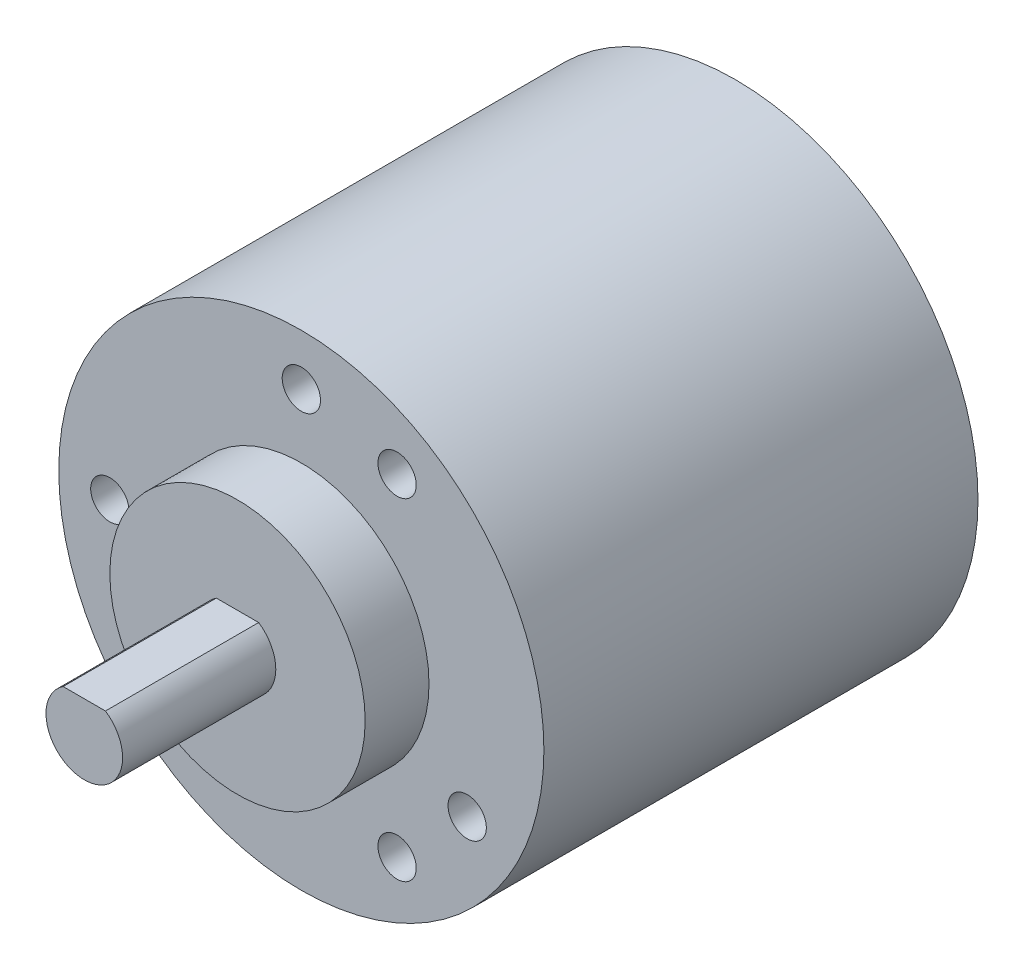
ISO-10303-21;
HEADER;
FILE_DESCRIPTION(('STEP AP214'),'2;1');
FILE_NAME('part.step','',(''),(''),'','','');
FILE_SCHEMA(('AUTOMOTIVE_DESIGN { 1 0 10303 214 1 1 1 1 }'));
ENDSEC;
DATA;
#1=APPLICATION_CONTEXT('core data for automotive mechanical design processes');
#2=APPLICATION_PROTOCOL_DEFINITION('international standard','automotive_design',2000,#1);
#3=PRODUCT_CONTEXT('',#1,'mechanical');
#4=PRODUCT('Part','Part','',(#3));
#5=PRODUCT_RELATED_PRODUCT_CATEGORY('part','',(#4));
#6=PRODUCT_DEFINITION_FORMATION('','',#4);
#7=PRODUCT_DEFINITION_CONTEXT('part definition',#1,'design');
#8=PRODUCT_DEFINITION('design','',#6,#7);
#9=PRODUCT_DEFINITION_SHAPE('','',#8);
#10=(LENGTH_UNIT() NAMED_UNIT(*) SI_UNIT(.MILLI.,.METRE.));
#11=(NAMED_UNIT(*) PLANE_ANGLE_UNIT() SI_UNIT($,.RADIAN.));
#12=(NAMED_UNIT(*) SI_UNIT($,.STERADIAN.) SOLID_ANGLE_UNIT());
#13=UNCERTAINTY_MEASURE_WITH_UNIT(LENGTH_MEASURE(1.E-05),#10,'distance_accuracy_value','');
#14=(GEOMETRIC_REPRESENTATION_CONTEXT(3) GLOBAL_UNCERTAINTY_ASSIGNED_CONTEXT((#13)) GLOBAL_UNIT_ASSIGNED_CONTEXT((#10,
#11,#12)) REPRESENTATION_CONTEXT('',''));
#15=CARTESIAN_POINT('',(0.,0.,0.));
#16=DIRECTION('',(0.,0.,1.));
#17=DIRECTION('',(1.,0.,0.));
#18=AXIS2_PLACEMENT_3D('',#15,#16,#17);
#19=CARTESIAN_POINT('',(0.,0.,34.));
#20=DIRECTION('',(0.,0.,-1.));
#21=DIRECTION('',(-1.,0.,0.));
#22=AXIS2_PLACEMENT_3D('',#19,#20,#21);
#23=CYLINDRICAL_SURFACE('',#22,19.);
#24=CARTESIAN_POINT('',(0.,0.,34.));
#25=DIRECTION('',(0.,0.,1.));
#26=DIRECTION('',(1.,0.,0.));
#27=AXIS2_PLACEMENT_3D('',#24,#25,#26);
#28=CIRCLE('',#27,19.);
#29=CARTESIAN_POINT('',(19.,0.,34.));
#30=VERTEX_POINT('',#29);
#31=EDGE_CURVE('E11',#30,#30,#28,.T.);
#32=ORIENTED_EDGE('',*,*,#31,.F.);
#33=EDGE_LOOP('',(#32));
#34=FACE_BOUND('',#33,.T.);
#35=CARTESIAN_POINT('',(0.,0.,0.));
#36=DIRECTION('',(0.,0.,1.));
#37=DIRECTION('',(1.,0.,0.));
#38=AXIS2_PLACEMENT_3D('',#35,#36,#37);
#39=CIRCLE('',#38,19.);
#40=CARTESIAN_POINT('',(19.,0.,0.));
#41=VERTEX_POINT('',#40);
#42=EDGE_CURVE('E40',#41,#41,#39,.T.);
#43=ORIENTED_EDGE('',*,*,#42,.T.);
#44=EDGE_LOOP('',(#43));
#45=FACE_BOUND('',#44,.T.);
#46=ADVANCED_FACE('F37',(#34,#45),#23,.T.);
#47=CARTESIAN_POINT('',(0.,0.,34.));
#48=DIRECTION('',(0.,0.,1.));
#49=DIRECTION('',(1.,0.,0.));
#50=AXIS2_PLACEMENT_3D('',#47,#48,#49);
#51=PLANE('',#50);
#52=CARTESIAN_POINT('',(0.,0.,34.));
#53=DIRECTION('',(0.,0.,1.));
#54=DIRECTION('',(1.,0.,0.));
#55=AXIS2_PLACEMENT_3D('',#52,#53,#54);
#56=CIRCLE('',#55,10.);
#57=CARTESIAN_POINT('',(10.,0.,34.));
#58=VERTEX_POINT('',#57);
#59=EDGE_CURVE('E79',#58,#58,#56,.T.);
#60=ORIENTED_EDGE('',*,*,#59,.F.);
#61=EDGE_LOOP('',(#60));
#62=FACE_BOUND('',#61,.T.);
#63=CARTESIAN_POINT('',(7.5000000000019,-12.9903810567662,34.));
#64=DIRECTION('',(0.,0.,1.));
#65=DIRECTION('',(1.,0.,0.));
#66=AXIS2_PLACEMENT_3D('',#63,#64,#65);
#67=CIRCLE('',#66,1.5);
#68=CARTESIAN_POINT('',(9.0000000000019,-12.9903810567662,34.));
#69=VERTEX_POINT('',#68);
#70=EDGE_CURVE('E86',#69,#69,#67,.T.);
#71=ORIENTED_EDGE('',*,*,#70,.F.);
#72=EDGE_LOOP('',(#71));
#73=FACE_BOUND('',#72,.T.);
#74=CARTESIAN_POINT('',(12.9903810567684,-7.49999999999967,34.));
#75=DIRECTION('',(0.,0.,1.));
#76=DIRECTION('',(1.,0.,0.));
#77=AXIS2_PLACEMENT_3D('',#74,#75,#76);
#78=CIRCLE('',#77,1.50000000000079);
#79=CARTESIAN_POINT('',(14.4903810567692,-7.49999999999967,34.));
#80=VERTEX_POINT('',#79);
#81=EDGE_CURVE('E111',#80,#80,#78,.T.);
#82=ORIENTED_EDGE('',*,*,#81,.F.);
#83=EDGE_LOOP('',(#82));
#84=FACE_BOUND('',#83,.T.);
#85=CARTESIAN_POINT('',(7.49999999999992,12.9903810567666,34.));
#86=DIRECTION('',(0.,0.,1.));
#87=DIRECTION('',(1.,0.,0.));
#88=AXIS2_PLACEMENT_3D('',#85,#86,#87);
#89=CIRCLE('',#88,1.5);
#90=CARTESIAN_POINT('',(8.99999999999992,12.9903810567666,34.));
#91=VERTEX_POINT('',#90);
#92=EDGE_CURVE('E105',#91,#91,#89,.T.);
#93=ORIENTED_EDGE('',*,*,#92,.F.);
#94=EDGE_LOOP('',(#93));
#95=FACE_BOUND('',#94,.T.);
#96=CARTESIAN_POINT('',(0.,15.,34.));
#97=DIRECTION('',(0.,0.,1.));
#98=DIRECTION('',(1.,0.,0.));
#99=AXIS2_PLACEMENT_3D('',#96,#97,#98);
#100=CIRCLE('',#99,1.5);
#101=CARTESIAN_POINT('',(1.5,15.,34.));
#102=VERTEX_POINT('',#101);
#103=EDGE_CURVE('E99',#102,#102,#100,.T.);
#104=ORIENTED_EDGE('',*,*,#103,.F.);
#105=EDGE_LOOP('',(#104));
#106=FACE_BOUND('',#105,.T.);
#107=CARTESIAN_POINT('',(-14.9999999999988,-1.5109441475758E-12,34.));
#108=DIRECTION('',(0.,0.,1.));
#109=DIRECTION('',(1.,0.,0.));
#110=AXIS2_PLACEMENT_3D('',#107,#108,#109);
#111=CIRCLE('',#110,1.5);
#112=CARTESIAN_POINT('',(-13.4999999999988,-1.5109441475758E-12,34.));
#113=VERTEX_POINT('',#112);
#114=EDGE_CURVE('E93',#113,#113,#111,.T.);
#115=ORIENTED_EDGE('',*,*,#114,.F.);
#116=EDGE_LOOP('',(#115));
#117=FACE_BOUND('',#116,.T.);
#118=CARTESIAN_POINT('',(-12.9903810567654,-7.50000000000142,34.));
#119=DIRECTION('',(0.,0.,1.));
#120=DIRECTION('',(1.,0.,0.));
#121=AXIS2_PLACEMENT_3D('',#118,#119,#120);
#122=CIRCLE('',#121,1.50000000000197);
#123=CARTESIAN_POINT('',(-11.4903810567634,-7.50000000000142,34.));
#124=VERTEX_POINT('',#123);
#125=EDGE_CURVE('E92',#124,#124,#122,.T.);
#126=ORIENTED_EDGE('',*,*,#125,.F.);
#127=EDGE_LOOP('',(#126));
#128=FACE_BOUND('',#127,.T.);
#129=ORIENTED_EDGE('',*,*,#31,.T.);
#130=EDGE_LOOP('',(#129));
#131=FACE_BOUND('',#130,.T.);
#132=ADVANCED_FACE('F127',(#62,#73,#84,#95,#106,#117,#128,#131),#51,.T.);
#133=CARTESIAN_POINT('',(0.,0.,0.));
#134=DIRECTION('',(0.,0.,1.));
#135=DIRECTION('',(1.,0.,0.));
#136=AXIS2_PLACEMENT_3D('',#133,#134,#135);
#137=PLANE('',#136);
#138=ORIENTED_EDGE('',*,*,#42,.F.);
#139=EDGE_LOOP('',(#138));
#140=FACE_BOUND('',#139,.T.);
#141=ADVANCED_FACE('F130',(#140),#137,.F.);
#142=CARTESIAN_POINT('',(-12.9903810567654,-7.50000000000142,28.));
#143=DIRECTION('',(0.,0.,1.));
#144=DIRECTION('',(1.,0.,0.));
#145=AXIS2_PLACEMENT_3D('',#142,#143,#144);
#146=CYLINDRICAL_SURFACE('',#145,1.50000000000197);
#147=CARTESIAN_POINT('',(-12.9903810567654,-7.50000000000142,28.));
#148=DIRECTION('',(0.,0.,1.));
#149=DIRECTION('',(1.,0.,0.));
#150=AXIS2_PLACEMENT_3D('',#147,#148,#149);
#151=CIRCLE('',#150,1.50000000000197);
#152=CARTESIAN_POINT('',(-11.4903810567634,-7.50000000000142,28.));
#153=VERTEX_POINT('',#152);
#154=EDGE_CURVE('E119',#153,#153,#151,.T.);
#155=ORIENTED_EDGE('',*,*,#154,.F.);
#156=EDGE_LOOP('',(#155));
#157=FACE_BOUND('',#156,.T.);
#158=ORIENTED_EDGE('',*,*,#125,.T.);
#159=EDGE_LOOP('',(#158));
#160=FACE_BOUND('',#159,.T.);
#161=ADVANCED_FACE('F125',(#157,#160),#146,.F.);
#162=CARTESIAN_POINT('',(0.,0.,28.));
#163=DIRECTION('',(0.,0.,1.));
#164=DIRECTION('',(1.,0.,0.));
#165=AXIS2_PLACEMENT_3D('',#162,#163,#164);
#166=PLANE('',#165);
#167=ORIENTED_EDGE('',*,*,#154,.T.);
#168=EDGE_LOOP('',(#167));
#169=FACE_BOUND('',#168,.T.);
#170=ADVANCED_FACE('F144',(#169),#166,.T.);
#171=CARTESIAN_POINT('',(-14.9999999999988,-1.5109441475758E-12,28.));
#172=DIRECTION('',(0.,0.,1.));
#173=DIRECTION('',(1.,0.,0.));
#174=AXIS2_PLACEMENT_3D('',#171,#172,#173);
#175=CYLINDRICAL_SURFACE('',#174,1.5);
#176=CARTESIAN_POINT('',(-14.9999999999988,-1.5109441475758E-12,28.));
#177=DIRECTION('',(0.,0.,1.));
#178=DIRECTION('',(1.,0.,0.));
#179=AXIS2_PLACEMENT_3D('',#176,#177,#178);
#180=CIRCLE('',#179,1.5);
#181=CARTESIAN_POINT('',(-13.4999999999988,-1.5109441475758E-12,28.));
#182=VERTEX_POINT('',#181);
#183=EDGE_CURVE('E89',#182,#182,#180,.T.);
#184=ORIENTED_EDGE('',*,*,#183,.F.);
#185=EDGE_LOOP('',(#184));
#186=FACE_BOUND('',#185,.T.);
#187=ORIENTED_EDGE('',*,*,#114,.T.);
#188=EDGE_LOOP('',(#187));
#189=FACE_BOUND('',#188,.T.);
#190=ADVANCED_FACE('F150',(#186,#189),#175,.F.);
#191=CARTESIAN_POINT('',(0.,0.,28.));
#192=DIRECTION('',(0.,0.,1.));
#193=DIRECTION('',(1.,0.,0.));
#194=AXIS2_PLACEMENT_3D('',#191,#192,#193);
#195=PLANE('',#194);
#196=ORIENTED_EDGE('',*,*,#183,.T.);
#197=EDGE_LOOP('',(#196));
#198=FACE_BOUND('',#197,.T.);
#199=ADVANCED_FACE('F181',(#198),#195,.T.);
#200=CARTESIAN_POINT('',(0.,15.,28.));
#201=DIRECTION('',(0.,0.,1.));
#202=DIRECTION('',(1.,0.,0.));
#203=AXIS2_PLACEMENT_3D('',#200,#201,#202);
#204=CYLINDRICAL_SURFACE('',#203,1.5);
#205=CARTESIAN_POINT('',(0.,15.,28.));
#206=DIRECTION('',(0.,0.,1.));
#207=DIRECTION('',(1.,0.,0.));
#208=AXIS2_PLACEMENT_3D('',#205,#206,#207);
#209=CIRCLE('',#208,1.5);
#210=CARTESIAN_POINT('',(1.5,15.,28.));
#211=VERTEX_POINT('',#210);
#212=EDGE_CURVE('E96',#211,#211,#209,.T.);
#213=ORIENTED_EDGE('',*,*,#212,.F.);
#214=EDGE_LOOP('',(#213));
#215=FACE_BOUND('',#214,.T.);
#216=ORIENTED_EDGE('',*,*,#103,.T.);
#217=EDGE_LOOP('',(#216));
#218=FACE_BOUND('',#217,.T.);
#219=ADVANCED_FACE('F178',(#215,#218),#204,.F.);
#220=CARTESIAN_POINT('',(0.,0.,28.));
#221=DIRECTION('',(0.,0.,1.));
#222=DIRECTION('',(1.,0.,0.));
#223=AXIS2_PLACEMENT_3D('',#220,#221,#222);
#224=PLANE('',#223);
#225=ORIENTED_EDGE('',*,*,#212,.T.);
#226=EDGE_LOOP('',(#225));
#227=FACE_BOUND('',#226,.T.);
#228=ADVANCED_FACE('F173',(#227),#224,.T.);
#229=CARTESIAN_POINT('',(7.49999999999992,12.9903810567666,28.));
#230=DIRECTION('',(0.,0.,1.));
#231=DIRECTION('',(1.,0.,0.));
#232=AXIS2_PLACEMENT_3D('',#229,#230,#231);
#233=CYLINDRICAL_SURFACE('',#232,1.5);
#234=CARTESIAN_POINT('',(7.49999999999992,12.9903810567666,28.));
#235=DIRECTION('',(0.,0.,1.));
#236=DIRECTION('',(1.,0.,0.));
#237=AXIS2_PLACEMENT_3D('',#234,#235,#236);
#238=CIRCLE('',#237,1.5);
#239=CARTESIAN_POINT('',(8.99999999999992,12.9903810567666,28.));
#240=VERTEX_POINT('',#239);
#241=EDGE_CURVE('E102',#240,#240,#238,.T.);
#242=ORIENTED_EDGE('',*,*,#241,.F.);
#243=EDGE_LOOP('',(#242));
#244=FACE_BOUND('',#243,.T.);
#245=ORIENTED_EDGE('',*,*,#92,.T.);
#246=EDGE_LOOP('',(#245));
#247=FACE_BOUND('',#246,.T.);
#248=ADVANCED_FACE('F170',(#244,#247),#233,.F.);
#249=CARTESIAN_POINT('',(0.,0.,28.));
#250=DIRECTION('',(0.,0.,1.));
#251=DIRECTION('',(1.,0.,0.));
#252=AXIS2_PLACEMENT_3D('',#249,#250,#251);
#253=PLANE('',#252);
#254=ORIENTED_EDGE('',*,*,#241,.T.);
#255=EDGE_LOOP('',(#254));
#256=FACE_BOUND('',#255,.T.);
#257=ADVANCED_FACE('F165',(#256),#253,.T.);
#258=CARTESIAN_POINT('',(12.9903810567684,-7.49999999999967,28.));
#259=DIRECTION('',(0.,0.,1.));
#260=DIRECTION('',(1.,0.,0.));
#261=AXIS2_PLACEMENT_3D('',#258,#259,#260);
#262=CYLINDRICAL_SURFACE('',#261,1.50000000000079);
#263=CARTESIAN_POINT('',(12.9903810567684,-7.49999999999967,28.));
#264=DIRECTION('',(0.,0.,1.));
#265=DIRECTION('',(1.,0.,0.));
#266=AXIS2_PLACEMENT_3D('',#263,#264,#265);
#267=CIRCLE('',#266,1.50000000000079);
#268=CARTESIAN_POINT('',(14.4903810567692,-7.49999999999967,28.));
#269=VERTEX_POINT('',#268);
#270=EDGE_CURVE('E108',#269,#269,#267,.T.);
#271=ORIENTED_EDGE('',*,*,#270,.F.);
#272=EDGE_LOOP('',(#271));
#273=FACE_BOUND('',#272,.T.);
#274=ORIENTED_EDGE('',*,*,#81,.T.);
#275=EDGE_LOOP('',(#274));
#276=FACE_BOUND('',#275,.T.);
#277=ADVANCED_FACE('F162',(#273,#276),#262,.F.);
#278=CARTESIAN_POINT('',(0.,0.,28.));
#279=DIRECTION('',(0.,0.,1.));
#280=DIRECTION('',(1.,0.,0.));
#281=AXIS2_PLACEMENT_3D('',#278,#279,#280);
#282=PLANE('',#281);
#283=ORIENTED_EDGE('',*,*,#270,.T.);
#284=EDGE_LOOP('',(#283));
#285=FACE_BOUND('',#284,.T.);
#286=ADVANCED_FACE('F156',(#285),#282,.T.);
#287=CARTESIAN_POINT('',(7.5000000000019,-12.9903810567662,28.));
#288=DIRECTION('',(0.,0.,1.));
#289=DIRECTION('',(1.,0.,0.));
#290=AXIS2_PLACEMENT_3D('',#287,#288,#289);
#291=CYLINDRICAL_SURFACE('',#290,1.5);
#292=CARTESIAN_POINT('',(7.5000000000019,-12.9903810567662,28.));
#293=DIRECTION('',(0.,0.,1.));
#294=DIRECTION('',(1.,0.,0.));
#295=AXIS2_PLACEMENT_3D('',#292,#293,#294);
#296=CIRCLE('',#295,1.5);
#297=CARTESIAN_POINT('',(9.0000000000019,-12.9903810567662,28.));
#298=VERTEX_POINT('',#297);
#299=EDGE_CURVE('E114',#298,#298,#296,.T.);
#300=ORIENTED_EDGE('',*,*,#299,.F.);
#301=EDGE_LOOP('',(#300));
#302=FACE_BOUND('',#301,.T.);
#303=ORIENTED_EDGE('',*,*,#70,.T.);
#304=EDGE_LOOP('',(#303));
#305=FACE_BOUND('',#304,.T.);
#306=ADVANCED_FACE('F152',(#302,#305),#291,.F.);
#307=CARTESIAN_POINT('',(0.,0.,28.));
#308=DIRECTION('',(0.,0.,1.));
#309=DIRECTION('',(1.,0.,0.));
#310=AXIS2_PLACEMENT_3D('',#307,#308,#309);
#311=PLANE('',#310);
#312=ORIENTED_EDGE('',*,*,#299,.T.);
#313=EDGE_LOOP('',(#312));
#314=FACE_BOUND('',#313,.T.);
#315=ADVANCED_FACE('F155',(#314),#311,.T.);
#316=CARTESIAN_POINT('',(0.,0.,39.));
#317=DIRECTION('',(0.,0.,-1.));
#318=DIRECTION('',(-1.,0.,0.));
#319=AXIS2_PLACEMENT_3D('',#316,#317,#318);
#320=CYLINDRICAL_SURFACE('',#319,10.);
#321=CARTESIAN_POINT('',(0.,0.,39.));
#322=DIRECTION('',(0.,0.,1.));
#323=DIRECTION('',(1.,0.,0.));
#324=AXIS2_PLACEMENT_3D('',#321,#322,#323);
#325=CIRCLE('',#324,10.);
#326=CARTESIAN_POINT('',(10.,0.,39.));
#327=VERTEX_POINT('',#326);
#328=EDGE_CURVE('E83',#327,#327,#325,.T.);
#329=ORIENTED_EDGE('',*,*,#328,.F.);
#330=EDGE_LOOP('',(#329));
#331=FACE_BOUND('',#330,.T.);
#332=ORIENTED_EDGE('',*,*,#59,.T.);
#333=EDGE_LOOP('',(#332));
#334=FACE_BOUND('',#333,.T.);
#335=ADVANCED_FACE('F160',(#331,#334),#320,.T.);
#336=CARTESIAN_POINT('',(0.,0.,39.));
#337=DIRECTION('',(0.,0.,1.));
#338=DIRECTION('',(1.,0.,0.));
#339=AXIS2_PLACEMENT_3D('',#336,#337,#338);
#340=PLANE('',#339);
#341=DIRECTION('',(-1.,0.,0.));
#342=VECTOR('',#341,1.);
#343=CARTESIAN_POINT('',(0.,2.5,39.));
#344=LINE('',#343,#342);
#345=CARTESIAN_POINT('',(1.6583123951777,2.5,39.));
#346=VERTEX_POINT('',#345);
#347=CARTESIAN_POINT('',(-1.6583123951777,2.5,39.));
#348=VERTEX_POINT('',#347);
#349=EDGE_CURVE('E63',#346,#348,#344,.T.);
#350=ORIENTED_EDGE('',*,*,#349,.F.);
#351=CARTESIAN_POINT('',(0.,0.,39.));
#352=DIRECTION('',(0.,0.,1.));
#353=DIRECTION('',(1.,0.,0.));
#354=AXIS2_PLACEMENT_3D('',#351,#352,#353);
#355=CIRCLE('',#354,3.);
#356=EDGE_CURVE('E50',#348,#346,#355,.T.);
#357=ORIENTED_EDGE('',*,*,#356,.F.);
#358=EDGE_LOOP('',(#350,#357));
#359=FACE_BOUND('',#358,.T.);
#360=ORIENTED_EDGE('',*,*,#328,.T.);
#361=EDGE_LOOP('',(#360));
#362=FACE_BOUND('',#361,.T.);
#363=ADVANCED_FACE('F64',(#359,#362),#340,.T.);
#364=CARTESIAN_POINT('',(0.,2.5,51.));
#365=DIRECTION('',(0.,-1.,0.));
#366=DIRECTION('',(0.,0.,-1.));
#367=AXIS2_PLACEMENT_3D('',#364,#365,#366);
#368=PLANE('',#367);
#369=ORIENTED_EDGE('',*,*,#349,.T.);
#370=DIRECTION('',(0.,0.,-1.));
#371=VECTOR('',#370,1.);
#372=CARTESIAN_POINT('',(-1.6583123951777,2.5,51.));
#373=LINE('',#372,#371);
#374=CARTESIAN_POINT('',(-1.6583123951777,2.5,51.));
#375=VERTEX_POINT('',#374);
#376=EDGE_CURVE('E74',#375,#348,#373,.T.);
#377=ORIENTED_EDGE('',*,*,#376,.F.);
#378=DIRECTION('',(-1.,0.,0.));
#379=VECTOR('',#378,1.);
#380=CARTESIAN_POINT('',(0.,2.5,51.));
#381=LINE('',#380,#379);
#382=CARTESIAN_POINT('',(1.6583123951777,2.5,51.));
#383=VERTEX_POINT('',#382);
#384=EDGE_CURVE('E75',#383,#375,#381,.T.);
#385=ORIENTED_EDGE('',*,*,#384,.F.);
#386=DIRECTION('',(0.,0.,-1.));
#387=VECTOR('',#386,1.);
#388=CARTESIAN_POINT('',(1.6583123951777,2.5,51.));
#389=LINE('',#388,#387);
#390=EDGE_CURVE('E72',#383,#346,#389,.T.);
#391=ORIENTED_EDGE('',*,*,#390,.T.);
#392=EDGE_LOOP('',(#369,#377,#385,#391));
#393=FACE_BOUND('',#392,.T.);
#394=ADVANCED_FACE('F77',(#393),#368,.F.);
#395=CARTESIAN_POINT('',(0.,0.,51.));
#396=DIRECTION('',(0.,0.,-1.));
#397=DIRECTION('',(-1.,0.,0.));
#398=AXIS2_PLACEMENT_3D('',#395,#396,#397);
#399=CYLINDRICAL_SURFACE('',#398,3.);
#400=ORIENTED_EDGE('',*,*,#356,.T.);
#401=ORIENTED_EDGE('',*,*,#390,.F.);
#402=CARTESIAN_POINT('',(0.,0.,51.));
#403=DIRECTION('',(0.,0.,1.));
#404=DIRECTION('',(1.,0.,0.));
#405=AXIS2_PLACEMENT_3D('',#402,#403,#404);
#406=CIRCLE('',#405,3.);
#407=EDGE_CURVE('E58',#375,#383,#406,.T.);
#408=ORIENTED_EDGE('',*,*,#407,.F.);
#409=ORIENTED_EDGE('',*,*,#376,.T.);
#410=EDGE_LOOP('',(#400,#401,#408,#409));
#411=FACE_BOUND('',#410,.T.);
#412=ADVANCED_FACE('F71',(#411),#399,.T.);
#413=CARTESIAN_POINT('',(0.,0.,51.));
#414=DIRECTION('',(0.,0.,1.));
#415=DIRECTION('',(1.,0.,0.));
#416=AXIS2_PLACEMENT_3D('',#413,#414,#415);
#417=PLANE('',#416);
#418=ORIENTED_EDGE('',*,*,#384,.T.);
#419=ORIENTED_EDGE('',*,*,#407,.T.);
#420=EDGE_LOOP('',(#418,#419));
#421=FACE_BOUND('',#420,.T.);
#422=ADVANCED_FACE('F201',(#421),#417,.T.);
#423=CLOSED_SHELL('',(#46,#132,#141,#161,#170,#190,#199,#219,#228,#248,#257,#277,#286,#306,#315,
#335,#363,#394,#412,#422));
#424=MANIFOLD_SOLID_BREP('B2',#423);
#425=ADVANCED_BREP_SHAPE_REPRESENTATION('',(#18,#424),#14);
#426=SHAPE_DEFINITION_REPRESENTATION(#9,#425);
ENDSEC;
END-ISO-10303-21;
